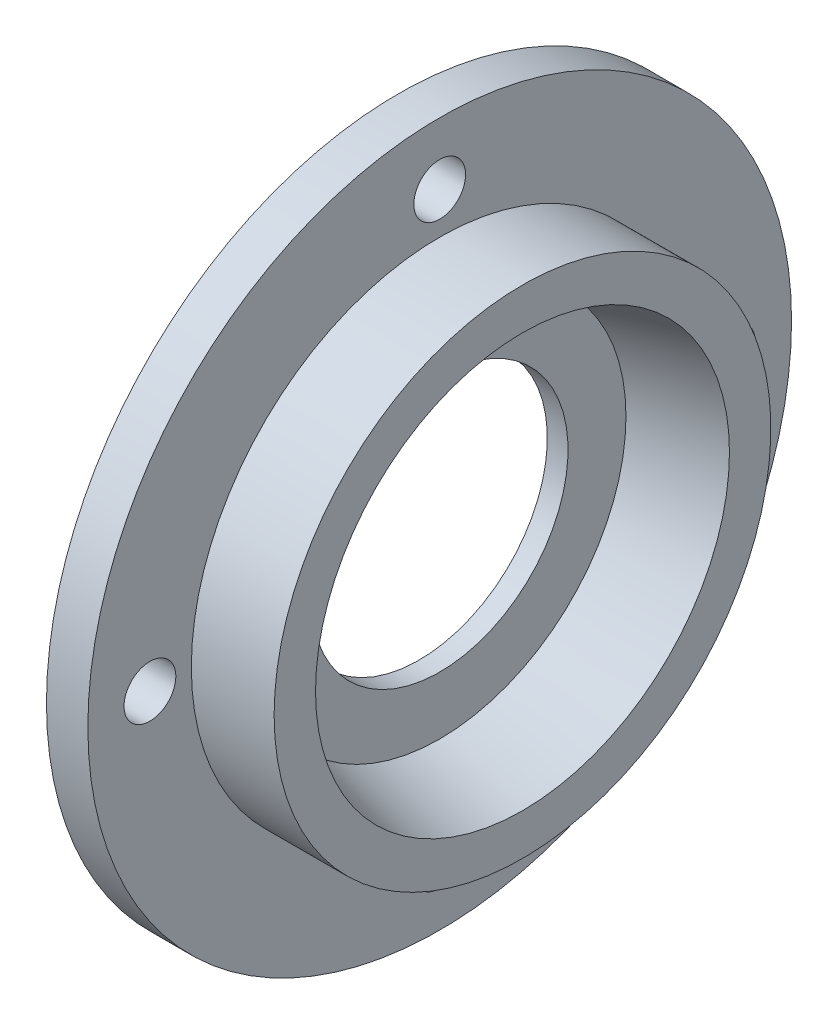
ISO-10303-21;
HEADER;
FILE_DESCRIPTION(('STEP AP214'),'2;1');
FILE_NAME('part.step','',(''),(''),'','','');
FILE_SCHEMA(('AUTOMOTIVE_DESIGN { 1 0 10303 214 1 1 1 1 }'));
ENDSEC;
DATA;
#1=APPLICATION_CONTEXT('core data for automotive mechanical design processes');
#2=APPLICATION_PROTOCOL_DEFINITION('international standard','automotive_design',2000,#1);
#3=PRODUCT_CONTEXT('',#1,'mechanical');
#4=PRODUCT('Part','Part','',(#3));
#5=PRODUCT_RELATED_PRODUCT_CATEGORY('part','',(#4));
#6=PRODUCT_DEFINITION_FORMATION('','',#4);
#7=PRODUCT_DEFINITION_CONTEXT('part definition',#1,'design');
#8=PRODUCT_DEFINITION('design','',#6,#7);
#9=PRODUCT_DEFINITION_SHAPE('','',#8);
#10=(LENGTH_UNIT() NAMED_UNIT(*) SI_UNIT(.MILLI.,.METRE.));
#11=(NAMED_UNIT(*) PLANE_ANGLE_UNIT() SI_UNIT($,.RADIAN.));
#12=(NAMED_UNIT(*) SI_UNIT($,.STERADIAN.) SOLID_ANGLE_UNIT());
#13=UNCERTAINTY_MEASURE_WITH_UNIT(LENGTH_MEASURE(1.E-05),#10,'distance_accuracy_value','');
#14=(GEOMETRIC_REPRESENTATION_CONTEXT(3) GLOBAL_UNCERTAINTY_ASSIGNED_CONTEXT((#13)) GLOBAL_UNIT_ASSIGNED_CONTEXT((#10,
#11,#12)) REPRESENTATION_CONTEXT('',''));
#15=CARTESIAN_POINT('',(0.,0.,0.));
#16=DIRECTION('',(0.,0.,1.));
#17=DIRECTION('',(1.,0.,0.));
#18=AXIS2_PLACEMENT_3D('',#15,#16,#17);
#19=CARTESIAN_POINT('',(0.,0.,0.));
#20=DIRECTION('',(1.,0.,0.));
#21=DIRECTION('',(0.,0.,-1.));
#22=AXIS2_PLACEMENT_3D('',#19,#20,#21);
#23=PLANE('',#22);
#24=CARTESIAN_POINT('',(0.,0.,0.));
#25=DIRECTION('',(-1.,0.,0.));
#26=DIRECTION('',(0.,0.,1.));
#27=AXIS2_PLACEMENT_3D('',#24,#25,#26);
#28=CIRCLE('',#27,12.);
#29=CARTESIAN_POINT('',(0.,0.,12.));
#30=VERTEX_POINT('',#29);
#31=EDGE_CURVE('E101',#30,#30,#28,.T.);
#32=ORIENTED_EDGE('',*,*,#31,.F.);
#33=EDGE_LOOP('',(#32));
#34=FACE_BOUND('',#33,.T.);
#35=CARTESIAN_POINT('',(0.,14.,0.));
#36=DIRECTION('',(-1.,0.,0.));
#37=DIRECTION('',(0.,0.,1.));
#38=AXIS2_PLACEMENT_3D('',#35,#36,#37);
#39=CIRCLE('',#38,1.25);
#40=CARTESIAN_POINT('',(0.,14.,1.25));
#41=VERTEX_POINT('',#40);
#42=EDGE_CURVE('E91',#41,#41,#39,.T.);
#43=ORIENTED_EDGE('',*,*,#42,.F.);
#44=EDGE_LOOP('',(#43));
#45=FACE_BOUND('',#44,.T.);
#46=CARTESIAN_POINT('',(0.,0.,14.));
#47=DIRECTION('',(-1.,0.,0.));
#48=DIRECTION('',(0.,0.,1.));
#49=AXIS2_PLACEMENT_3D('',#46,#47,#48);
#50=CIRCLE('',#49,1.25);
#51=CARTESIAN_POINT('',(0.,0.,15.25));
#52=VERTEX_POINT('',#51);
#53=EDGE_CURVE('E83',#52,#52,#50,.T.);
#54=ORIENTED_EDGE('',*,*,#53,.F.);
#55=EDGE_LOOP('',(#54));
#56=FACE_BOUND('',#55,.T.);
#57=CARTESIAN_POINT('',(0.,-14.,0.));
#58=DIRECTION('',(-1.,0.,0.));
#59=DIRECTION('',(0.,0.,1.));
#60=AXIS2_PLACEMENT_3D('',#57,#58,#59);
#61=CIRCLE('',#60,1.25);
#62=CARTESIAN_POINT('',(0.,-14.,1.25));
#63=VERTEX_POINT('',#62);
#64=EDGE_CURVE('E73',#63,#63,#61,.T.);
#65=ORIENTED_EDGE('',*,*,#64,.F.);
#66=EDGE_LOOP('',(#65));
#67=FACE_BOUND('',#66,.T.);
#68=CARTESIAN_POINT('',(0.,0.,-14.));
#69=DIRECTION('',(-1.,0.,0.));
#70=DIRECTION('',(0.,0.,1.));
#71=AXIS2_PLACEMENT_3D('',#68,#69,#70);
#72=CIRCLE('',#71,1.25);
#73=CARTESIAN_POINT('',(0.,0.,-12.75));
#74=VERTEX_POINT('',#73);
#75=EDGE_CURVE('E74',#74,#74,#72,.T.);
#76=ORIENTED_EDGE('',*,*,#75,.F.);
#77=EDGE_LOOP('',(#76));
#78=FACE_BOUND('',#77,.T.);
#79=CARTESIAN_POINT('',(0.,0.,0.));
#80=DIRECTION('',(-1.,0.,0.));
#81=DIRECTION('',(0.,0.,1.));
#82=AXIS2_PLACEMENT_3D('',#79,#80,#81);
#83=CIRCLE('',#82,17.);
#84=CARTESIAN_POINT('',(0.,0.,17.));
#85=VERTEX_POINT('',#84);
#86=EDGE_CURVE('E10',#85,#85,#83,.T.);
#87=ORIENTED_EDGE('',*,*,#86,.T.);
#88=EDGE_LOOP('',(#87));
#89=FACE_BOUND('',#88,.T.);
#90=ADVANCED_FACE('F37',(#34,#45,#56,#67,#78,#89),#23,.F.);
#91=CARTESIAN_POINT('',(0.,0.,0.));
#92=DIRECTION('',(-1.,0.,0.));
#93=DIRECTION('',(0.,0.,1.));
#94=AXIS2_PLACEMENT_3D('',#91,#92,#93);
#95=CYLINDRICAL_SURFACE('',#94,17.);
#96=ORIENTED_EDGE('',*,*,#86,.F.);
#97=EDGE_LOOP('',(#96));
#98=FACE_BOUND('',#97,.T.);
#99=CARTESIAN_POINT('',(2.,0.,0.));
#100=DIRECTION('',(-1.,0.,0.));
#101=DIRECTION('',(0.,0.,1.));
#102=AXIS2_PLACEMENT_3D('',#99,#100,#101);
#103=CIRCLE('',#102,17.);
#104=CARTESIAN_POINT('',(2.,0.,17.));
#105=VERTEX_POINT('',#104);
#106=EDGE_CURVE('E44',#105,#105,#103,.T.);
#107=ORIENTED_EDGE('',*,*,#106,.T.);
#108=EDGE_LOOP('',(#107));
#109=FACE_BOUND('',#108,.T.);
#110=ADVANCED_FACE('F135',(#98,#109),#95,.T.);
#111=CARTESIAN_POINT('',(2.,17.,0.));
#112=DIRECTION('',(-1.,0.,0.));
#113=DIRECTION('',(0.,0.,1.));
#114=AXIS2_PLACEMENT_3D('',#111,#112,#113);
#115=PLANE('',#114);
#116=CARTESIAN_POINT('',(2.,14.,0.));
#117=DIRECTION('',(-1.,0.,0.));
#118=DIRECTION('',(0.,0.,1.));
#119=AXIS2_PLACEMENT_3D('',#116,#117,#118);
#120=CIRCLE('',#119,1.25);
#121=CARTESIAN_POINT('',(2.,14.,1.25));
#122=VERTEX_POINT('',#121);
#123=EDGE_CURVE('E68',#122,#122,#120,.F.);
#124=ORIENTED_EDGE('',*,*,#123,.F.);
#125=EDGE_LOOP('',(#124));
#126=FACE_BOUND('',#125,.T.);
#127=CARTESIAN_POINT('',(2.,0.,14.));
#128=DIRECTION('',(-1.,0.,0.));
#129=DIRECTION('',(0.,0.,1.));
#130=AXIS2_PLACEMENT_3D('',#127,#128,#129);
#131=CIRCLE('',#130,1.25);
#132=CARTESIAN_POINT('',(2.,0.,15.25));
#133=VERTEX_POINT('',#132);
#134=EDGE_CURVE('E87',#133,#133,#131,.F.);
#135=ORIENTED_EDGE('',*,*,#134,.F.);
#136=EDGE_LOOP('',(#135));
#137=FACE_BOUND('',#136,.T.);
#138=CARTESIAN_POINT('',(2.,-14.,0.));
#139=DIRECTION('',(-1.,0.,0.));
#140=DIRECTION('',(0.,0.,1.));
#141=AXIS2_PLACEMENT_3D('',#138,#139,#140);
#142=CIRCLE('',#141,1.25);
#143=CARTESIAN_POINT('',(2.,-14.,1.25));
#144=VERTEX_POINT('',#143);
#145=EDGE_CURVE('E79',#144,#144,#142,.F.);
#146=ORIENTED_EDGE('',*,*,#145,.F.);
#147=EDGE_LOOP('',(#146));
#148=FACE_BOUND('',#147,.T.);
#149=CARTESIAN_POINT('',(2.,0.,-14.));
#150=DIRECTION('',(-1.,0.,0.));
#151=DIRECTION('',(0.,0.,1.));
#152=AXIS2_PLACEMENT_3D('',#149,#150,#151);
#153=CIRCLE('',#152,1.25);
#154=CARTESIAN_POINT('',(2.,0.,-12.75));
#155=VERTEX_POINT('',#154);
#156=EDGE_CURVE('E69',#155,#155,#153,.F.);
#157=ORIENTED_EDGE('',*,*,#156,.F.);
#158=EDGE_LOOP('',(#157));
#159=FACE_BOUND('',#158,.T.);
#160=ORIENTED_EDGE('',*,*,#106,.F.);
#161=EDGE_LOOP('',(#160));
#162=FACE_BOUND('',#161,.T.);
#163=CARTESIAN_POINT('',(2.,0.,0.));
#164=DIRECTION('',(-1.,0.,0.));
#165=DIRECTION('',(0.,0.,1.));
#166=AXIS2_PLACEMENT_3D('',#163,#164,#165);
#167=CIRCLE('',#166,12.);
#168=CARTESIAN_POINT('',(2.,0.,12.));
#169=VERTEX_POINT('',#168);
#170=EDGE_CURVE('E49',#169,#169,#167,.T.);
#171=ORIENTED_EDGE('',*,*,#170,.T.);
#172=EDGE_LOOP('',(#171));
#173=FACE_BOUND('',#172,.T.);
#174=ADVANCED_FACE('F152',(#126,#137,#148,#159,#162,#173),#115,.F.);
#175=CARTESIAN_POINT('',(0.,0.,0.));
#176=DIRECTION('',(-1.,0.,0.));
#177=DIRECTION('',(0.,0.,1.));
#178=AXIS2_PLACEMENT_3D('',#175,#176,#177);
#179=CYLINDRICAL_SURFACE('',#178,12.);
#180=ORIENTED_EDGE('',*,*,#170,.F.);
#181=EDGE_LOOP('',(#180));
#182=FACE_BOUND('',#181,.T.);
#183=CARTESIAN_POINT('',(6.,0.,0.));
#184=DIRECTION('',(-1.,0.,0.));
#185=DIRECTION('',(0.,0.,1.));
#186=AXIS2_PLACEMENT_3D('',#183,#184,#185);
#187=CIRCLE('',#186,12.);
#188=CARTESIAN_POINT('',(6.,0.,12.));
#189=VERTEX_POINT('',#188);
#190=EDGE_CURVE('E54',#189,#189,#187,.T.);
#191=ORIENTED_EDGE('',*,*,#190,.T.);
#192=EDGE_LOOP('',(#191));
#193=FACE_BOUND('',#192,.T.);
#194=ADVANCED_FACE('F155',(#182,#193),#179,.T.);
#195=CARTESIAN_POINT('',(6.,12.,0.));
#196=DIRECTION('',(-1.,0.,0.));
#197=DIRECTION('',(0.,0.,1.));
#198=AXIS2_PLACEMENT_3D('',#195,#196,#197);
#199=PLANE('',#198);
#200=ORIENTED_EDGE('',*,*,#190,.F.);
#201=EDGE_LOOP('',(#200));
#202=FACE_BOUND('',#201,.T.);
#203=CARTESIAN_POINT('',(6.,0.,0.));
#204=DIRECTION('',(-1.,0.,0.));
#205=DIRECTION('',(0.,0.,1.));
#206=AXIS2_PLACEMENT_3D('',#203,#204,#205);
#207=CIRCLE('',#206,10.);
#208=CARTESIAN_POINT('',(6.,0.,10.));
#209=VERTEX_POINT('',#208);
#210=EDGE_CURVE('E60',#209,#209,#207,.T.);
#211=ORIENTED_EDGE('',*,*,#210,.T.);
#212=EDGE_LOOP('',(#211));
#213=FACE_BOUND('',#212,.T.);
#214=ADVANCED_FACE('F163',(#202,#213),#199,.F.);
#215=CARTESIAN_POINT('',(2.,0.,0.));
#216=DIRECTION('',(1.,0.,0.));
#217=DIRECTION('',(0.,0.,-1.));
#218=AXIS2_PLACEMENT_3D('',#215,#216,#217);
#219=CONICAL_SURFACE('',#218,9.,0.244978663126864);
#220=ORIENTED_EDGE('',*,*,#210,.F.);
#221=EDGE_LOOP('',(#220));
#222=FACE_BOUND('',#221,.T.);
#223=CARTESIAN_POINT('',(2.,0.,0.));
#224=DIRECTION('',(-1.,0.,0.));
#225=DIRECTION('',(0.,0.,1.));
#226=AXIS2_PLACEMENT_3D('',#223,#224,#225);
#227=CIRCLE('',#226,9.);
#228=CARTESIAN_POINT('',(2.,0.,9.));
#229=VERTEX_POINT('',#228);
#230=EDGE_CURVE('E64',#229,#229,#227,.T.);
#231=ORIENTED_EDGE('',*,*,#230,.T.);
#232=EDGE_LOOP('',(#231));
#233=FACE_BOUND('',#232,.T.);
#234=ADVANCED_FACE('F169',(#222,#233),#219,.F.);
#235=CARTESIAN_POINT('',(2.,9.,0.));
#236=DIRECTION('',(-1.,0.,0.));
#237=DIRECTION('',(0.,0.,1.));
#238=AXIS2_PLACEMENT_3D('',#235,#236,#237);
#239=PLANE('',#238);
#240=CARTESIAN_POINT('',(2.,0.,0.));
#241=DIRECTION('',(-1.,0.,0.));
#242=DIRECTION('',(0.,0.,1.));
#243=AXIS2_PLACEMENT_3D('',#240,#241,#242);
#244=CIRCLE('',#243,6.2);
#245=CARTESIAN_POINT('',(2.,0.,6.2));
#246=VERTEX_POINT('',#245);
#247=EDGE_CURVE('E105',#246,#246,#244,.F.);
#248=ORIENTED_EDGE('',*,*,#247,.F.);
#249=EDGE_LOOP('',(#248));
#250=FACE_BOUND('',#249,.T.);
#251=ORIENTED_EDGE('',*,*,#230,.F.);
#252=EDGE_LOOP('',(#251));
#253=FACE_BOUND('',#252,.T.);
#254=ADVANCED_FACE('F148',(#250,#253),#239,.F.);
#255=CARTESIAN_POINT('',(6.001,0.,-14.));
#256=DIRECTION('',(-1.,0.,0.));
#257=DIRECTION('',(0.,0.,1.));
#258=AXIS2_PLACEMENT_3D('',#255,#256,#257);
#259=CYLINDRICAL_SURFACE('',#258,1.25);
#260=ORIENTED_EDGE('',*,*,#75,.T.);
#261=EDGE_LOOP('',(#260));
#262=FACE_BOUND('',#261,.T.);
#263=ORIENTED_EDGE('',*,*,#156,.T.);
#264=EDGE_LOOP('',(#263));
#265=FACE_BOUND('',#264,.T.);
#266=ADVANCED_FACE('F144',(#262,#265),#259,.F.);
#267=CARTESIAN_POINT('',(6.001,-14.,0.));
#268=DIRECTION('',(-1.,0.,0.));
#269=DIRECTION('',(0.,0.,1.));
#270=AXIS2_PLACEMENT_3D('',#267,#268,#269);
#271=CYLINDRICAL_SURFACE('',#270,1.25);
#272=ORIENTED_EDGE('',*,*,#64,.T.);
#273=EDGE_LOOP('',(#272));
#274=FACE_BOUND('',#273,.T.);
#275=ORIENTED_EDGE('',*,*,#145,.T.);
#276=EDGE_LOOP('',(#275));
#277=FACE_BOUND('',#276,.T.);
#278=ADVANCED_FACE('F147',(#274,#277),#271,.F.);
#279=CARTESIAN_POINT('',(6.001,0.,14.));
#280=DIRECTION('',(-1.,0.,0.));
#281=DIRECTION('',(0.,0.,1.));
#282=AXIS2_PLACEMENT_3D('',#279,#280,#281);
#283=CYLINDRICAL_SURFACE('',#282,1.25);
#284=ORIENTED_EDGE('',*,*,#53,.T.);
#285=EDGE_LOOP('',(#284));
#286=FACE_BOUND('',#285,.T.);
#287=ORIENTED_EDGE('',*,*,#134,.T.);
#288=EDGE_LOOP('',(#287));
#289=FACE_BOUND('',#288,.T.);
#290=ADVANCED_FACE('F230',(#286,#289),#283,.F.);
#291=CARTESIAN_POINT('',(6.001,14.,0.));
#292=DIRECTION('',(-1.,0.,0.));
#293=DIRECTION('',(0.,0.,1.));
#294=AXIS2_PLACEMENT_3D('',#291,#292,#293);
#295=CYLINDRICAL_SURFACE('',#294,1.25);
#296=ORIENTED_EDGE('',*,*,#42,.T.);
#297=EDGE_LOOP('',(#296));
#298=FACE_BOUND('',#297,.T.);
#299=ORIENTED_EDGE('',*,*,#123,.T.);
#300=EDGE_LOOP('',(#299));
#301=FACE_BOUND('',#300,.T.);
#302=ADVANCED_FACE('F129',(#298,#301),#295,.F.);
#303=CARTESIAN_POINT('',(1.,0.,0.));
#304=DIRECTION('',(-1.,0.,0.));
#305=DIRECTION('',(0.,0.,1.));
#306=AXIS2_PLACEMENT_3D('',#303,#304,#305);
#307=CYLINDRICAL_SURFACE('',#306,12.);
#308=CARTESIAN_POINT('',(1.,0.,0.));
#309=DIRECTION('',(-1.,0.,0.));
#310=DIRECTION('',(0.,0.,1.));
#311=AXIS2_PLACEMENT_3D('',#308,#309,#310);
#312=CIRCLE('',#311,12.);
#313=CARTESIAN_POINT('',(1.,0.,12.));
#314=VERTEX_POINT('',#313);
#315=EDGE_CURVE('E78',#314,#314,#312,.T.);
#316=ORIENTED_EDGE('',*,*,#315,.F.);
#317=EDGE_LOOP('',(#316));
#318=FACE_BOUND('',#317,.T.);
#319=ORIENTED_EDGE('',*,*,#31,.T.);
#320=EDGE_LOOP('',(#319));
#321=FACE_BOUND('',#320,.T.);
#322=ADVANCED_FACE('F123',(#318,#321),#307,.F.);
#323=CARTESIAN_POINT('',(1.,0.,0.));
#324=DIRECTION('',(-1.,0.,0.));
#325=DIRECTION('',(0.,0.,1.));
#326=AXIS2_PLACEMENT_3D('',#323,#324,#325);
#327=PLANE('',#326);
#328=CARTESIAN_POINT('',(1.,0.,0.));
#329=DIRECTION('',(-1.,0.,0.));
#330=DIRECTION('',(0.,0.,1.));
#331=AXIS2_PLACEMENT_3D('',#328,#329,#330);
#332=CIRCLE('',#331,6.2);
#333=CARTESIAN_POINT('',(1.,0.,6.2));
#334=VERTEX_POINT('',#333);
#335=EDGE_CURVE('E112',#334,#334,#332,.T.);
#336=ORIENTED_EDGE('',*,*,#335,.F.);
#337=EDGE_LOOP('',(#336));
#338=FACE_BOUND('',#337,.T.);
#339=ORIENTED_EDGE('',*,*,#315,.T.);
#340=EDGE_LOOP('',(#339));
#341=FACE_BOUND('',#340,.T.);
#342=ADVANCED_FACE('F120',(#338,#341),#327,.T.);
#343=CARTESIAN_POINT('',(6.001,0.,0.));
#344=DIRECTION('',(-1.,0.,0.));
#345=DIRECTION('',(0.,0.,1.));
#346=AXIS2_PLACEMENT_3D('',#343,#344,#345);
#347=CYLINDRICAL_SURFACE('',#346,6.2);
#348=ORIENTED_EDGE('',*,*,#335,.T.);
#349=EDGE_LOOP('',(#348));
#350=FACE_BOUND('',#349,.T.);
#351=ORIENTED_EDGE('',*,*,#247,.T.);
#352=EDGE_LOOP('',(#351));
#353=FACE_BOUND('',#352,.T.);
#354=ADVANCED_FACE('F117',(#350,#353),#347,.F.);
#355=CLOSED_SHELL('',(#90,#110,#174,#194,#214,#234,#254,#266,#278,#290,#302,#322,#342,#354));
#356=MANIFOLD_SOLID_BREP('B2',#355);
#357=ADVANCED_BREP_SHAPE_REPRESENTATION('',(#18,#356),#14);
#358=SHAPE_DEFINITION_REPRESENTATION(#9,#357);
ENDSEC;
END-ISO-10303-21;
